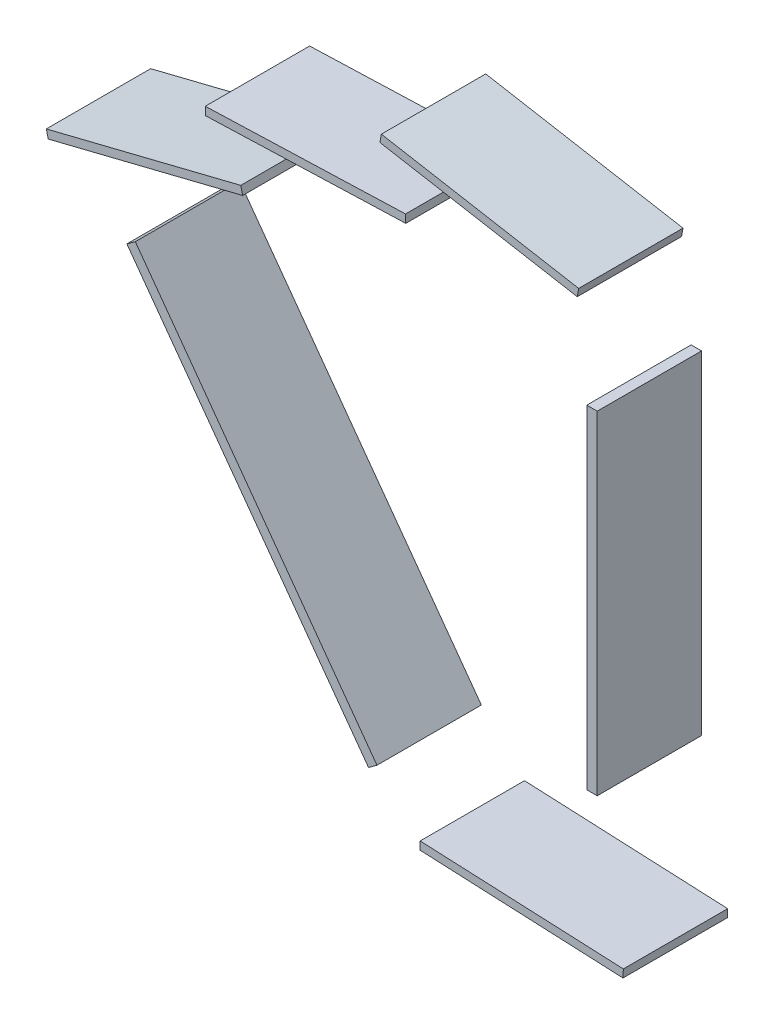
ISO-10303-21;
HEADER;
FILE_DESCRIPTION(('STEP AP214'),'2;1');
FILE_NAME('part.step','',(''),(''),'','','');
FILE_SCHEMA(('AUTOMOTIVE_DESIGN { 1 0 10303 214 1 1 1 1 }'));
ENDSEC;
DATA;
#1=APPLICATION_CONTEXT('core data for automotive mechanical design processes');
#2=APPLICATION_PROTOCOL_DEFINITION('international standard','automotive_design',2000,#1);
#3=PRODUCT_CONTEXT('',#1,'mechanical');
#4=PRODUCT('Part','Part','',(#3));
#5=PRODUCT_RELATED_PRODUCT_CATEGORY('part','',(#4));
#6=PRODUCT_DEFINITION_FORMATION('','',#4);
#7=PRODUCT_DEFINITION_CONTEXT('part definition',#1,'design');
#8=PRODUCT_DEFINITION('design','',#6,#7);
#9=PRODUCT_DEFINITION_SHAPE('','',#8);
#10=(LENGTH_UNIT() NAMED_UNIT(*) SI_UNIT(.MILLI.,.METRE.));
#11=(NAMED_UNIT(*) PLANE_ANGLE_UNIT() SI_UNIT($,.RADIAN.));
#12=(NAMED_UNIT(*) SI_UNIT($,.STERADIAN.) SOLID_ANGLE_UNIT());
#13=UNCERTAINTY_MEASURE_WITH_UNIT(LENGTH_MEASURE(1.E-05),#10,'distance_accuracy_value','');
#14=(GEOMETRIC_REPRESENTATION_CONTEXT(3) GLOBAL_UNCERTAINTY_ASSIGNED_CONTEXT((#13)) GLOBAL_UNIT_ASSIGNED_CONTEXT((#10,
#11,#12)) REPRESENTATION_CONTEXT('',''));
#15=CARTESIAN_POINT('',(0.,0.,0.));
#16=DIRECTION('',(0.,0.,1.));
#17=DIRECTION('',(1.,0.,0.));
#18=AXIS2_PLACEMENT_3D('',#15,#16,#17);
#19=CARTESIAN_POINT('',(-1.,38.7624072998269,10.));
#20=DIRECTION('',(1.,0.,0.));
#21=DIRECTION('',(0.,1.,0.));
#22=AXIS2_PLACEMENT_3D('',#19,#20,#21);
#23=PLANE('',#22);
#24=DIRECTION('',(0.,-1.,0.));
#25=VECTOR('',#24,1.);
#26=CARTESIAN_POINT('',(-1.,38.7624072998269,0.));
#27=LINE('',#26,#25);
#28=CARTESIAN_POINT('',(-1.,70.6810573309413,0.));
#29=VERTEX_POINT('',#28);
#30=CARTESIAN_POINT('',(-1.,38.7624072998269,0.));
#31=VERTEX_POINT('',#30);
#32=EDGE_CURVE('E106',#29,#31,#27,.T.);
#33=ORIENTED_EDGE('',*,*,#32,.T.);
#34=DIRECTION('',(0.,0.,-1.));
#35=VECTOR('',#34,1.);
#36=CARTESIAN_POINT('',(-1.,38.7624072998269,10.));
#37=LINE('',#36,#35);
#38=CARTESIAN_POINT('',(-1.,38.7624072998269,10.));
#39=VERTEX_POINT('',#38);
#40=EDGE_CURVE('E12',#39,#31,#37,.T.);
#41=ORIENTED_EDGE('',*,*,#40,.F.);
#42=DIRECTION('',(0.,-1.,0.));
#43=VECTOR('',#42,1.);
#44=CARTESIAN_POINT('',(-1.,38.7624072998269,10.));
#45=LINE('',#44,#43);
#46=CARTESIAN_POINT('',(-1.,70.6810573309413,10.));
#47=VERTEX_POINT('',#46);
#48=EDGE_CURVE('E94',#47,#39,#45,.T.);
#49=ORIENTED_EDGE('',*,*,#48,.F.);
#50=DIRECTION('',(0.,0.,-1.));
#51=VECTOR('',#50,1.);
#52=CARTESIAN_POINT('',(-1.,70.6810573309413,10.));
#53=LINE('',#52,#51);
#54=EDGE_CURVE('E102',#47,#29,#53,.T.);
#55=ORIENTED_EDGE('',*,*,#54,.T.);
#56=EDGE_LOOP('',(#33,#41,#49,#55));
#57=FACE_BOUND('',#56,.T.);
#58=ADVANCED_FACE('F43',(#57),#23,.F.);
#59=CARTESIAN_POINT('',(0.,38.7624072998269,10.));
#60=DIRECTION('',(0.,1.,0.));
#61=DIRECTION('',(0.,0.,1.));
#62=AXIS2_PLACEMENT_3D('',#59,#60,#61);
#63=PLANE('',#62);
#64=DIRECTION('',(1.,0.,0.));
#65=VECTOR('',#64,1.);
#66=CARTESIAN_POINT('',(0.,38.7624072998269,0.));
#67=LINE('',#66,#65);
#68=CARTESIAN_POINT('',(0.,38.7624072998269,0.));
#69=VERTEX_POINT('',#68);
#70=EDGE_CURVE('E98',#31,#69,#67,.T.);
#71=ORIENTED_EDGE('',*,*,#70,.T.);
#72=DIRECTION('',(0.,0.,-1.));
#73=VECTOR('',#72,1.);
#74=CARTESIAN_POINT('',(0.,38.7624072998269,10.));
#75=LINE('',#74,#73);
#76=CARTESIAN_POINT('',(0.,38.7624072998269,10.));
#77=VERTEX_POINT('',#76);
#78=EDGE_CURVE('E51',#77,#69,#75,.T.);
#79=ORIENTED_EDGE('',*,*,#78,.F.);
#80=DIRECTION('',(1.,0.,0.));
#81=VECTOR('',#80,1.);
#82=CARTESIAN_POINT('',(0.,38.7624072998269,10.));
#83=LINE('',#82,#81);
#84=EDGE_CURVE('E89',#39,#77,#83,.T.);
#85=ORIENTED_EDGE('',*,*,#84,.F.);
#86=ORIENTED_EDGE('',*,*,#40,.T.);
#87=EDGE_LOOP('',(#71,#79,#85,#86));
#88=FACE_BOUND('',#87,.T.);
#89=ADVANCED_FACE('F97',(#88),#63,.F.);
#90=CARTESIAN_POINT('',(0.,70.6810573309413,10.));
#91=DIRECTION('',(-1.,0.,0.));
#92=DIRECTION('',(0.,-1.,0.));
#93=AXIS2_PLACEMENT_3D('',#90,#91,#92);
#94=PLANE('',#93);
#95=DIRECTION('',(0.,1.,0.));
#96=VECTOR('',#95,1.);
#97=CARTESIAN_POINT('',(0.,70.6810573309413,0.));
#98=LINE('',#97,#96);
#99=CARTESIAN_POINT('',(0.,70.6810573309413,0.));
#100=VERTEX_POINT('',#99);
#101=EDGE_CURVE('E76',#69,#100,#98,.T.);
#102=ORIENTED_EDGE('',*,*,#101,.T.);
#103=DIRECTION('',(0.,0.,-1.));
#104=VECTOR('',#103,1.);
#105=CARTESIAN_POINT('',(0.,70.6810573309413,10.));
#106=LINE('',#105,#104);
#107=CARTESIAN_POINT('',(0.,70.6810573309413,10.));
#108=VERTEX_POINT('',#107);
#109=EDGE_CURVE('E99',#108,#100,#106,.T.);
#110=ORIENTED_EDGE('',*,*,#109,.F.);
#111=DIRECTION('',(0.,1.,0.));
#112=VECTOR('',#111,1.);
#113=CARTESIAN_POINT('',(0.,70.6810573309413,10.));
#114=LINE('',#113,#112);
#115=EDGE_CURVE('E92',#77,#108,#114,.T.);
#116=ORIENTED_EDGE('',*,*,#115,.F.);
#117=ORIENTED_EDGE('',*,*,#78,.T.);
#118=EDGE_LOOP('',(#102,#110,#116,#117));
#119=FACE_BOUND('',#118,.T.);
#120=ADVANCED_FACE('F100',(#119),#94,.F.);
#121=CARTESIAN_POINT('',(-1.,70.6810573309413,10.));
#122=DIRECTION('',(0.,-1.,0.));
#123=DIRECTION('',(1.,0.,0.));
#124=AXIS2_PLACEMENT_3D('',#121,#122,#123);
#125=PLANE('',#124);
#126=DIRECTION('',(-1.,0.,0.));
#127=VECTOR('',#126,1.);
#128=CARTESIAN_POINT('',(-1.,70.6810573309413,0.));
#129=LINE('',#128,#127);
#130=EDGE_CURVE('E82',#100,#29,#129,.T.);
#131=ORIENTED_EDGE('',*,*,#130,.T.);
#132=ORIENTED_EDGE('',*,*,#54,.F.);
#133=DIRECTION('',(-1.,0.,0.));
#134=VECTOR('',#133,1.);
#135=CARTESIAN_POINT('',(-1.,70.6810573309413,10.));
#136=LINE('',#135,#134);
#137=EDGE_CURVE('E59',#108,#47,#136,.T.);
#138=ORIENTED_EDGE('',*,*,#137,.F.);
#139=ORIENTED_EDGE('',*,*,#109,.T.);
#140=EDGE_LOOP('',(#131,#132,#138,#139));
#141=FACE_BOUND('',#140,.T.);
#142=ADVANCED_FACE('F113',(#141),#125,.F.);
#143=CARTESIAN_POINT('',(-1.,70.6810573309413,10.));
#144=DIRECTION('',(0.,0.,-1.));
#145=DIRECTION('',(-1.,0.,0.));
#146=AXIS2_PLACEMENT_3D('',#143,#144,#145);
#147=PLANE('',#146);
#148=ORIENTED_EDGE('',*,*,#48,.T.);
#149=ORIENTED_EDGE('',*,*,#84,.T.);
#150=ORIENTED_EDGE('',*,*,#115,.T.);
#151=ORIENTED_EDGE('',*,*,#137,.T.);
#152=EDGE_LOOP('',(#148,#149,#150,#151));
#153=FACE_BOUND('',#152,.T.);
#154=ADVANCED_FACE('F90',(#153),#147,.F.);
#155=CARTESIAN_POINT('',(-1.,70.6810573309413,0.));
#156=DIRECTION('',(0.,0.,-1.));
#157=DIRECTION('',(-1.,0.,0.));
#158=AXIS2_PLACEMENT_3D('',#155,#156,#157);
#159=PLANE('',#158);
#160=ORIENTED_EDGE('',*,*,#32,.F.);
#161=ORIENTED_EDGE('',*,*,#130,.F.);
#162=ORIENTED_EDGE('',*,*,#101,.F.);
#163=ORIENTED_EDGE('',*,*,#70,.F.);
#164=EDGE_LOOP('',(#160,#161,#162,#163));
#165=FACE_BOUND('',#164,.T.);
#166=ADVANCED_FACE('F116',(#165),#159,.T.);
#167=CLOSED_SHELL('',(#58,#89,#120,#142,#154,#166));
#168=MANIFOLD_SOLID_BREP('B2',#167);
#169=CARTESIAN_POINT('',(-21.910642755924,30.1574125551564,10.));
#170=DIRECTION('',(0.809016994374946,0.587785252292475,0.));
#171=DIRECTION('',(-0.587785252292475,0.809016994374946,0.));
#172=AXIS2_PLACEMENT_3D('',#169,#170,#171);
#173=PLANE('',#172);
#174=DIRECTION('',(0.587785252292475,-0.809016994374946,0.));
#175=VECTOR('',#174,1.);
#176=CARTESIAN_POINT('',(-21.910642755924,30.1574125551564,0.));
#177=LINE('',#176,#175);
#178=CARTESIAN_POINT('',(-45.0661788434705,62.0282737848731,0.));
#179=VERTEX_POINT('',#178);
#180=CARTESIAN_POINT('',(-21.910642755924,30.1574125551564,0.));
#181=VERTEX_POINT('',#180);
#182=EDGE_CURVE('E239',#179,#181,#177,.T.);
#183=ORIENTED_EDGE('',*,*,#182,.T.);
#184=DIRECTION('',(0.,0.,-1.));
#185=VECTOR('',#184,1.);
#186=CARTESIAN_POINT('',(-21.910642755924,30.1574125551564,10.));
#187=LINE('',#186,#185);
#188=CARTESIAN_POINT('',(-21.910642755924,30.1574125551564,10.));
#189=VERTEX_POINT('',#188);
#190=EDGE_CURVE('E41',#189,#181,#187,.T.);
#191=ORIENTED_EDGE('',*,*,#190,.F.);
#192=DIRECTION('',(0.587785252292475,-0.809016994374946,0.));
#193=VECTOR('',#192,1.);
#194=CARTESIAN_POINT('',(-21.910642755924,30.1574125551564,10.));
#195=LINE('',#194,#193);
#196=CARTESIAN_POINT('',(-45.0661788434705,62.0282737848731,10.));
#197=VERTEX_POINT('',#196);
#198=EDGE_CURVE('E227',#197,#189,#195,.T.);
#199=ORIENTED_EDGE('',*,*,#198,.F.);
#200=DIRECTION('',(0.,0.,-1.));
#201=VECTOR('',#200,1.);
#202=CARTESIAN_POINT('',(-45.0661788434705,62.0282737848731,10.));
#203=LINE('',#202,#201);
#204=EDGE_CURVE('E235',#197,#179,#203,.T.);
#205=ORIENTED_EDGE('',*,*,#204,.T.);
#206=EDGE_LOOP('',(#183,#191,#199,#205));
#207=FACE_BOUND('',#206,.T.);
#208=ADVANCED_FACE('F176',(#207),#173,.F.);
#209=CARTESIAN_POINT('',(-21.1016257615491,30.7451978074489,10.));
#210=DIRECTION('',(-0.587785252292471,0.809016994374949,0.));
#211=DIRECTION('',(-0.809016994374949,-0.587785252292471,0.));
#212=AXIS2_PLACEMENT_3D('',#209,#210,#211);
#213=PLANE('',#212);
#214=DIRECTION('',(0.809016994374949,0.587785252292471,0.));
#215=VECTOR('',#214,1.);
#216=CARTESIAN_POINT('',(-21.1016257615491,30.7451978074489,0.));
#217=LINE('',#216,#215);
#218=CARTESIAN_POINT('',(-21.1016257615491,30.7451978074489,0.));
#219=VERTEX_POINT('',#218);
#220=EDGE_CURVE('E231',#181,#219,#217,.T.);
#221=ORIENTED_EDGE('',*,*,#220,.T.);
#222=DIRECTION('',(0.,0.,-1.));
#223=VECTOR('',#222,1.);
#224=CARTESIAN_POINT('',(-21.1016257615491,30.7451978074489,10.));
#225=LINE('',#224,#223);
#226=CARTESIAN_POINT('',(-21.1016257615491,30.7451978074489,10.));
#227=VERTEX_POINT('',#226);
#228=EDGE_CURVE('E184',#227,#219,#225,.T.);
#229=ORIENTED_EDGE('',*,*,#228,.F.);
#230=DIRECTION('',(0.809016994374949,0.587785252292471,0.));
#231=VECTOR('',#230,1.);
#232=CARTESIAN_POINT('',(-21.1016257615491,30.7451978074489,10.));
#233=LINE('',#232,#231);
#234=EDGE_CURVE('E222',#189,#227,#233,.T.);
#235=ORIENTED_EDGE('',*,*,#234,.F.);
#236=ORIENTED_EDGE('',*,*,#190,.T.);
#237=EDGE_LOOP('',(#221,#229,#235,#236));
#238=FACE_BOUND('',#237,.T.);
#239=ADVANCED_FACE('F230',(#238),#213,.F.);
#240=CARTESIAN_POINT('',(-44.2571618490956,62.6160590371655,10.));
#241=DIRECTION('',(-0.809016994374946,-0.587785252292475,0.));
#242=DIRECTION('',(0.587785252292475,-0.809016994374946,0.));
#243=AXIS2_PLACEMENT_3D('',#240,#241,#242);
#244=PLANE('',#243);
#245=DIRECTION('',(-0.587785252292475,0.809016994374946,0.));
#246=VECTOR('',#245,1.);
#247=CARTESIAN_POINT('',(-44.2571618490956,62.6160590371655,0.));
#248=LINE('',#247,#246);
#249=CARTESIAN_POINT('',(-44.2571618490956,62.6160590371655,0.));
#250=VERTEX_POINT('',#249);
#251=EDGE_CURVE('E209',#219,#250,#248,.T.);
#252=ORIENTED_EDGE('',*,*,#251,.T.);
#253=DIRECTION('',(0.,0.,-1.));
#254=VECTOR('',#253,1.);
#255=CARTESIAN_POINT('',(-44.2571618490956,62.6160590371655,10.));
#256=LINE('',#255,#254);
#257=CARTESIAN_POINT('',(-44.2571618490956,62.6160590371655,10.));
#258=VERTEX_POINT('',#257);
#259=EDGE_CURVE('E232',#258,#250,#256,.T.);
#260=ORIENTED_EDGE('',*,*,#259,.F.);
#261=DIRECTION('',(-0.587785252292475,0.809016994374946,0.));
#262=VECTOR('',#261,1.);
#263=CARTESIAN_POINT('',(-44.2571618490956,62.6160590371655,10.));
#264=LINE('',#263,#262);
#265=EDGE_CURVE('E225',#227,#258,#264,.T.);
#266=ORIENTED_EDGE('',*,*,#265,.F.);
#267=ORIENTED_EDGE('',*,*,#228,.T.);
#268=EDGE_LOOP('',(#252,#260,#266,#267));
#269=FACE_BOUND('',#268,.T.);
#270=ADVANCED_FACE('F233',(#269),#244,.F.);
#271=CARTESIAN_POINT('',(-45.0661788434705,62.0282737848731,10.));
#272=DIRECTION('',(0.587785252292479,-0.809016994374943,0.));
#273=DIRECTION('',(0.809016994374943,0.587785252292479,0.));
#274=AXIS2_PLACEMENT_3D('',#271,#272,#273);
#275=PLANE('',#274);
#276=DIRECTION('',(-0.809016994374943,-0.587785252292479,0.));
#277=VECTOR('',#276,1.);
#278=CARTESIAN_POINT('',(-45.0661788434705,62.0282737848731,0.));
#279=LINE('',#278,#277);
#280=EDGE_CURVE('E215',#250,#179,#279,.T.);
#281=ORIENTED_EDGE('',*,*,#280,.T.);
#282=ORIENTED_EDGE('',*,*,#204,.F.);
#283=DIRECTION('',(-0.809016994374943,-0.587785252292479,0.));
#284=VECTOR('',#283,1.);
#285=CARTESIAN_POINT('',(-45.0661788434705,62.0282737848731,10.));
#286=LINE('',#285,#284);
#287=EDGE_CURVE('E192',#258,#197,#286,.T.);
#288=ORIENTED_EDGE('',*,*,#287,.F.);
#289=ORIENTED_EDGE('',*,*,#259,.T.);
#290=EDGE_LOOP('',(#281,#282,#288,#289));
#291=FACE_BOUND('',#290,.T.);
#292=ADVANCED_FACE('F246',(#291),#275,.F.);
#293=CARTESIAN_POINT('',(-45.0661788434705,62.0282737848731,10.));
#294=DIRECTION('',(0.,0.,-1.));
#295=DIRECTION('',(-1.,0.,0.));
#296=AXIS2_PLACEMENT_3D('',#293,#294,#295);
#297=PLANE('',#296);
#298=ORIENTED_EDGE('',*,*,#198,.T.);
#299=ORIENTED_EDGE('',*,*,#234,.T.);
#300=ORIENTED_EDGE('',*,*,#265,.T.);
#301=ORIENTED_EDGE('',*,*,#287,.T.);
#302=EDGE_LOOP('',(#298,#299,#300,#301));
#303=FACE_BOUND('',#302,.T.);
#304=ADVANCED_FACE('F223',(#303),#297,.F.);
#305=CARTESIAN_POINT('',(-45.0661788434705,62.0282737848731,0.));
#306=DIRECTION('',(0.,0.,-1.));
#307=DIRECTION('',(-1.,0.,0.));
#308=AXIS2_PLACEMENT_3D('',#305,#306,#307);
#309=PLANE('',#308);
#310=ORIENTED_EDGE('',*,*,#182,.F.);
#311=ORIENTED_EDGE('',*,*,#280,.F.);
#312=ORIENTED_EDGE('',*,*,#251,.F.);
#313=ORIENTED_EDGE('',*,*,#220,.F.);
#314=EDGE_LOOP('',(#310,#311,#312,#313));
#315=FACE_BOUND('',#314,.T.);
#316=ADVANCED_FACE('F249',(#315),#309,.T.);
#317=CLOSED_SHELL('',(#208,#239,#270,#292,#304,#316));
#318=MANIFOLD_SOLID_BREP('B6',#317);
#319=CARTESIAN_POINT('',(-16.9638016194686,26.5341118977669,10.));
#320=DIRECTION('',(0.998967048924741,-0.0454404573325794,0.));
#321=DIRECTION('',(0.0454404573325794,0.998967048924741,0.));
#322=AXIS2_PLACEMENT_3D('',#319,#320,#321);
#323=PLANE('',#322);
#324=DIRECTION('',(-0.0454404573325795,-0.998967048924741,0.));
#325=VECTOR('',#324,1.);
#326=CARTESIAN_POINT('',(-16.9638016194686,26.5341118977669,0.));
#327=LINE('',#326,#325);
#328=CARTESIAN_POINT('',(-16.9638016194686,26.5341118977669,0.));
#329=VERTEX_POINT('',#328);
#330=CARTESIAN_POINT('',(-16.9988634763464,25.7633089228166,0.));
#331=VERTEX_POINT('',#330);
#332=EDGE_CURVE('E363',#329,#331,#327,.T.);
#333=ORIENTED_EDGE('',*,*,#332,.T.);
#334=DIRECTION('',(0.,0.,-1.));
#335=VECTOR('',#334,1.);
#336=CARTESIAN_POINT('',(-16.9988634763464,25.7633089228166,10.));
#337=LINE('',#336,#335);
#338=CARTESIAN_POINT('',(-16.9988634763464,25.7633089228166,10.));
#339=VERTEX_POINT('',#338);
#340=EDGE_CURVE('E317',#339,#331,#337,.T.);
#341=ORIENTED_EDGE('',*,*,#340,.F.);
#342=DIRECTION('',(-0.0454404573325795,-0.998967048924741,0.));
#343=VECTOR('',#342,1.);
#344=CARTESIAN_POINT('',(-16.9638016194686,26.5341118977669,10.));
#345=LINE('',#344,#343);
#346=CARTESIAN_POINT('',(-16.9638016194686,26.5341118977669,10.));
#347=VERTEX_POINT('',#346);
#348=EDGE_CURVE('E355',#347,#339,#345,.T.);
#349=ORIENTED_EDGE('',*,*,#348,.F.);
#350=DIRECTION('',(0.,0.,-1.));
#351=VECTOR('',#350,1.);
#352=CARTESIAN_POINT('',(-16.9638016194686,26.5341118977669,10.));
#353=LINE('',#352,#351);
#354=EDGE_CURVE('E174',#347,#329,#353,.T.);
#355=ORIENTED_EDGE('',*,*,#354,.T.);
#356=EDGE_LOOP('',(#333,#341,#349,#355));
#357=FACE_BOUND('',#356,.T.);
#358=ADVANCED_FACE('F309',(#357),#323,.F.);
#359=CARTESIAN_POINT('',(-16.7108612761414,25.7502084389676,10.));
#360=DIRECTION('',(0.045440457332583,0.998967048924741,0.));
#361=DIRECTION('',(-0.998967048924741,0.045440457332583,0.));
#362=AXIS2_PLACEMENT_3D('',#359,#360,#361);
#363=PLANE('',#362);
#364=DIRECTION('',(0.998967048924741,-0.045440457332583,0.));
#365=VECTOR('',#364,1.);
#366=CARTESIAN_POINT('',(-16.7108612761414,25.7502084389676,0.));
#367=LINE('',#366,#365);
#368=CARTESIAN_POINT('',(2.46930606321363,24.877751658182,0.));
#369=VERTEX_POINT('',#368);
#370=EDGE_CURVE('E342',#331,#369,#367,.T.);
#371=ORIENTED_EDGE('',*,*,#370,.T.);
#372=DIRECTION('',(0.,0.,-1.));
#373=VECTOR('',#372,1.);
#374=CARTESIAN_POINT('',(2.46930606321363,24.877751658182,10.));
#375=LINE('',#374,#373);
#376=CARTESIAN_POINT('',(2.46930606321363,24.877751658182,10.));
#377=VERTEX_POINT('',#376);
#378=EDGE_CURVE('E364',#377,#369,#375,.T.);
#379=ORIENTED_EDGE('',*,*,#378,.F.);
#380=DIRECTION('',(0.998967048924741,-0.045440457332584,0.));
#381=VECTOR('',#380,1.);
#382=CARTESIAN_POINT('',(-16.9988634763464,25.7633089228166,10.));
#383=LINE('',#382,#381);
#384=EDGE_CURVE('E359',#339,#377,#383,.T.);
#385=ORIENTED_EDGE('',*,*,#384,.F.);
#386=ORIENTED_EDGE('',*,*,#340,.T.);
#387=EDGE_LOOP('',(#371,#379,#385,#386));
#388=FACE_BOUND('',#387,.T.);
#389=ADVANCED_FACE('F365',(#388),#363,.F.);
#390=CARTESIAN_POINT('',(2.50436792009146,25.6485546331323,10.));
#391=DIRECTION('',(-0.99896704892474,0.0454404573326004,0.));
#392=DIRECTION('',(-0.0454404573326004,-0.99896704892474,0.));
#393=AXIS2_PLACEMENT_3D('',#390,#391,#392);
#394=PLANE('',#393);
#395=DIRECTION('',(0.0454404573326004,0.99896704892474,0.));
#396=VECTOR('',#395,1.);
#397=CARTESIAN_POINT('',(2.50436792009146,25.6485546331323,0.));
#398=LINE('',#397,#396);
#399=CARTESIAN_POINT('',(2.50436792009146,25.6485546331323,0.));
#400=VERTEX_POINT('',#399);
#401=EDGE_CURVE('E349',#369,#400,#398,.T.);
#402=ORIENTED_EDGE('',*,*,#401,.T.);
#403=DIRECTION('',(0.,0.,-1.));
#404=VECTOR('',#403,1.);
#405=CARTESIAN_POINT('',(2.50436792009146,25.6485546331323,10.));
#406=LINE('',#405,#404);
#407=CARTESIAN_POINT('',(2.50436792009146,25.6485546331323,10.));
#408=VERTEX_POINT('',#407);
#409=EDGE_CURVE('E369',#408,#400,#406,.T.);
#410=ORIENTED_EDGE('',*,*,#409,.F.);
#411=DIRECTION('',(0.0454404573326004,0.99896704892474,0.));
#412=VECTOR('',#411,1.);
#413=CARTESIAN_POINT('',(2.50436792009146,25.6485546331323,10.));
#414=LINE('',#413,#412);
#415=EDGE_CURVE('E367',#377,#408,#414,.T.);
#416=ORIENTED_EDGE('',*,*,#415,.F.);
#417=ORIENTED_EDGE('',*,*,#378,.T.);
#418=EDGE_LOOP('',(#402,#410,#416,#417));
#419=FACE_BOUND('',#418,.T.);
#420=ADVANCED_FACE('F379',(#419),#394,.F.);
#421=CARTESIAN_POINT('',(-16.6757994192636,26.5210114139179,10.));
#422=DIRECTION('',(-0.045440457332583,-0.998967048924741,0.));
#423=DIRECTION('',(0.998967048924741,-0.045440457332583,0.));
#424=AXIS2_PLACEMENT_3D('',#421,#422,#423);
#425=PLANE('',#424);
#426=DIRECTION('',(-0.998967048924741,0.045440457332583,0.));
#427=VECTOR('',#426,1.);
#428=CARTESIAN_POINT('',(-16.6757994192636,26.5210114139179,0.));
#429=LINE('',#428,#427);
#430=EDGE_CURVE('E376',#400,#329,#429,.T.);
#431=ORIENTED_EDGE('',*,*,#430,.T.);
#432=ORIENTED_EDGE('',*,*,#354,.F.);
#433=DIRECTION('',(-0.998967048924742,0.0454404573325589,0.));
#434=VECTOR('',#433,1.);
#435=CARTESIAN_POINT('',(-16.6757994192636,26.5210114139179,10.));
#436=LINE('',#435,#434);
#437=EDGE_CURVE('E325',#408,#347,#436,.T.);
#438=ORIENTED_EDGE('',*,*,#437,.F.);
#439=ORIENTED_EDGE('',*,*,#409,.T.);
#440=EDGE_LOOP('',(#431,#432,#438,#439));
#441=FACE_BOUND('',#440,.T.);
#442=ADVANCED_FACE('F383',(#441),#425,.F.);
#443=CARTESIAN_POINT('',(-16.9638016194686,26.5341118977669,10.));
#444=DIRECTION('',(0.,0.,1.));
#445=DIRECTION('',(1.,0.,0.));
#446=AXIS2_PLACEMENT_3D('',#443,#444,#445);
#447=PLANE('',#446);
#448=ORIENTED_EDGE('',*,*,#437,.T.);
#449=ORIENTED_EDGE('',*,*,#348,.T.);
#450=ORIENTED_EDGE('',*,*,#384,.T.);
#451=ORIENTED_EDGE('',*,*,#415,.T.);
#452=EDGE_LOOP('',(#448,#449,#450,#451));
#453=FACE_BOUND('',#452,.T.);
#454=ADVANCED_FACE('F357',(#453),#447,.T.);
#455=CARTESIAN_POINT('',(-16.9638016194686,26.5341118977669,0.));
#456=DIRECTION('',(0.,0.,1.));
#457=DIRECTION('',(1.,0.,0.));
#458=AXIS2_PLACEMENT_3D('',#455,#456,#457);
#459=PLANE('',#458);
#460=ORIENTED_EDGE('',*,*,#332,.F.);
#461=ORIENTED_EDGE('',*,*,#430,.F.);
#462=ORIENTED_EDGE('',*,*,#401,.F.);
#463=ORIENTED_EDGE('',*,*,#370,.F.);
#464=EDGE_LOOP('',(#460,#461,#462,#463));
#465=FACE_BOUND('',#464,.T.);
#466=ADVANCED_FACE('F382',(#465),#459,.F.);
#467=CLOSED_SHELL('',(#358,#389,#420,#442,#454,#466));
#468=MANIFOLD_SOLID_BREP('B35',#467);
#469=CARTESIAN_POINT('',(-20.6826291580252,83.3264981054563,10.));
#470=DIRECTION('',(-0.174282532081888,-0.98469568853079,0.));
#471=DIRECTION('',(0.98469568853079,-0.174282532081888,0.));
#472=AXIS2_PLACEMENT_3D('',#469,#470,#471);
#473=PLANE('',#472);
#474=DIRECTION('',(-0.98469568853079,0.174282532081888,0.));
#475=VECTOR('',#474,1.);
#476=CARTESIAN_POINT('',(-20.6826291580252,83.3264981054563,0.));
#477=LINE('',#476,#475);
#478=CARTESIAN_POINT('',(-1.77647193823407,79.9802734894841,0.));
#479=VERTEX_POINT('',#478);
#480=CARTESIAN_POINT('',(-20.6826291580252,83.3264981054563,0.));
#481=VERTEX_POINT('',#480);
#482=EDGE_CURVE('E511',#479,#481,#477,.T.);
#483=ORIENTED_EDGE('',*,*,#482,.T.);
#484=DIRECTION('',(0.,0.,-1.));
#485=VECTOR('',#484,1.);
#486=CARTESIAN_POINT('',(-20.6826291580252,83.3264981054563,10.));
#487=LINE('',#486,#485);
#488=CARTESIAN_POINT('',(-20.6826291580252,83.3264981054563,10.));
#489=VERTEX_POINT('',#488);
#490=EDGE_CURVE('E307',#489,#481,#487,.T.);
#491=ORIENTED_EDGE('',*,*,#490,.F.);
#492=DIRECTION('',(-0.98469568853079,0.174282532081888,0.));
#493=VECTOR('',#492,1.);
#494=CARTESIAN_POINT('',(-20.6826291580252,83.3264981054563,10.));
#495=LINE('',#494,#493);
#496=CARTESIAN_POINT('',(-1.77647193823407,79.9802734894841,10.));
#497=VERTEX_POINT('',#496);
#498=EDGE_CURVE('E499',#497,#489,#495,.T.);
#499=ORIENTED_EDGE('',*,*,#498,.F.);
#500=DIRECTION('',(0.,0.,-1.));
#501=VECTOR('',#500,1.);
#502=CARTESIAN_POINT('',(-1.77647193823407,79.9802734894841,10.));
#503=LINE('',#502,#501);
#504=EDGE_CURVE('E507',#497,#479,#503,.T.);
#505=ORIENTED_EDGE('',*,*,#504,.T.);
#506=EDGE_LOOP('',(#483,#491,#499,#505));
#507=FACE_BOUND('',#506,.T.);
#508=ADVANCED_FACE('F448',(#507),#473,.F.);
#509=CARTESIAN_POINT('',(-20.6826291580252,83.3264981054563,10.));
#510=DIRECTION('',(0.984695688530788,-0.174282532081897,0.));
#511=DIRECTION('',(0.174282532081897,0.984695688530788,0.));
#512=AXIS2_PLACEMENT_3D('',#509,#510,#511);
#513=PLANE('',#512);
#514=DIRECTION('',(-0.174282532081897,-0.984695688530788,0.));
#515=VECTOR('',#514,1.);
#516=CARTESIAN_POINT('',(-20.6826291580252,83.3264981054563,0.));
#517=LINE('',#516,#515);
#518=CARTESIAN_POINT('',(-20.8171055597796,82.566706912186,0.));
#519=VERTEX_POINT('',#518);
#520=EDGE_CURVE('E503',#481,#519,#517,.T.);
#521=ORIENTED_EDGE('',*,*,#520,.T.);
#522=DIRECTION('',(0.,0.,-1.));
#523=VECTOR('',#522,1.);
#524=CARTESIAN_POINT('',(-20.8171055597796,82.566706912186,10.));
#525=LINE('',#524,#523);
#526=CARTESIAN_POINT('',(-20.8171055597796,82.566706912186,10.));
#527=VERTEX_POINT('',#526);
#528=EDGE_CURVE('E456',#527,#519,#525,.T.);
#529=ORIENTED_EDGE('',*,*,#528,.F.);
#530=DIRECTION('',(-0.174282532081897,-0.984695688530788,0.));
#531=VECTOR('',#530,1.);
#532=CARTESIAN_POINT('',(-20.6826291580252,83.3264981054563,10.));
#533=LINE('',#532,#531);
#534=EDGE_CURVE('E494',#489,#527,#533,.T.);
#535=ORIENTED_EDGE('',*,*,#534,.F.);
#536=ORIENTED_EDGE('',*,*,#490,.T.);
#537=EDGE_LOOP('',(#521,#529,#535,#536));
#538=FACE_BOUND('',#537,.T.);
#539=ADVANCED_FACE('F502',(#538),#513,.F.);
#540=CARTESIAN_POINT('',(-20.8171055597796,82.566706912186,10.));
#541=DIRECTION('',(0.174282532081888,0.98469568853079,0.));
#542=DIRECTION('',(-0.98469568853079,0.174282532081888,0.));
#543=AXIS2_PLACEMENT_3D('',#540,#541,#542);
#544=PLANE('',#543);
#545=DIRECTION('',(0.98469568853079,-0.174282532081888,0.));
#546=VECTOR('',#545,1.);
#547=CARTESIAN_POINT('',(-20.8171055597796,82.566706912186,0.));
#548=LINE('',#547,#546);
#549=CARTESIAN_POINT('',(-1.91094833998846,79.2204822962137,0.));
#550=VERTEX_POINT('',#549);
#551=EDGE_CURVE('E481',#519,#550,#548,.T.);
#552=ORIENTED_EDGE('',*,*,#551,.T.);
#553=DIRECTION('',(0.,0.,-1.));
#554=VECTOR('',#553,1.);
#555=CARTESIAN_POINT('',(-1.91094833998846,79.2204822962137,10.));
#556=LINE('',#555,#554);
#557=CARTESIAN_POINT('',(-1.91094833998846,79.2204822962137,10.));
#558=VERTEX_POINT('',#557);
#559=EDGE_CURVE('E504',#558,#550,#556,.T.);
#560=ORIENTED_EDGE('',*,*,#559,.F.);
#561=DIRECTION('',(0.98469568853079,-0.174282532081888,0.));
#562=VECTOR('',#561,1.);
#563=CARTESIAN_POINT('',(-20.8171055597796,82.566706912186,10.));
#564=LINE('',#563,#562);
#565=EDGE_CURVE('E497',#527,#558,#564,.T.);
#566=ORIENTED_EDGE('',*,*,#565,.F.);
#567=ORIENTED_EDGE('',*,*,#528,.T.);
#568=EDGE_LOOP('',(#552,#560,#566,#567));
#569=FACE_BOUND('',#568,.T.);
#570=ADVANCED_FACE('F505',(#569),#544,.F.);
#571=CARTESIAN_POINT('',(-1.77647193823407,79.9802734894841,10.));
#572=DIRECTION('',(-0.984695688530788,0.174282532081898,0.));
#573=DIRECTION('',(-0.174282532081898,-0.984695688530788,0.));
#574=AXIS2_PLACEMENT_3D('',#571,#572,#573);
#575=PLANE('',#574);
#576=DIRECTION('',(0.174282532081898,0.984695688530788,0.));
#577=VECTOR('',#576,1.);
#578=CARTESIAN_POINT('',(-1.77647193823407,79.9802734894841,0.));
#579=LINE('',#578,#577);
#580=EDGE_CURVE('E487',#550,#479,#579,.T.);
#581=ORIENTED_EDGE('',*,*,#580,.T.);
#582=ORIENTED_EDGE('',*,*,#504,.F.);
#583=DIRECTION('',(0.174282532081898,0.984695688530788,0.));
#584=VECTOR('',#583,1.);
#585=CARTESIAN_POINT('',(-1.77647193823407,79.9802734894841,10.));
#586=LINE('',#585,#584);
#587=EDGE_CURVE('E464',#558,#497,#586,.T.);
#588=ORIENTED_EDGE('',*,*,#587,.F.);
#589=ORIENTED_EDGE('',*,*,#559,.T.);
#590=EDGE_LOOP('',(#581,#582,#588,#589));
#591=FACE_BOUND('',#590,.T.);
#592=ADVANCED_FACE('F518',(#591),#575,.F.);
#593=CARTESIAN_POINT('',(-1.77647193823407,79.9802734894841,10.));
#594=DIRECTION('',(0.,0.,-1.));
#595=DIRECTION('',(-1.,0.,0.));
#596=AXIS2_PLACEMENT_3D('',#593,#594,#595);
#597=PLANE('',#596);
#598=ORIENTED_EDGE('',*,*,#498,.T.);
#599=ORIENTED_EDGE('',*,*,#534,.T.);
#600=ORIENTED_EDGE('',*,*,#565,.T.);
#601=ORIENTED_EDGE('',*,*,#587,.T.);
#602=EDGE_LOOP('',(#598,#599,#600,#601));
#603=FACE_BOUND('',#602,.T.);
#604=ADVANCED_FACE('F495',(#603),#597,.F.);
#605=CARTESIAN_POINT('',(-1.77647193823407,79.9802734894841,0.));
#606=DIRECTION('',(0.,0.,-1.));
#607=DIRECTION('',(-1.,0.,0.));
#608=AXIS2_PLACEMENT_3D('',#605,#606,#607);
#609=PLANE('',#608);
#610=ORIENTED_EDGE('',*,*,#482,.F.);
#611=ORIENTED_EDGE('',*,*,#580,.F.);
#612=ORIENTED_EDGE('',*,*,#551,.F.);
#613=ORIENTED_EDGE('',*,*,#520,.F.);
#614=EDGE_LOOP('',(#610,#611,#612,#613));
#615=FACE_BOUND('',#614,.T.);
#616=ADVANCED_FACE('F521',(#615),#609,.T.);
#617=CLOSED_SHELL('',(#508,#539,#570,#592,#604,#616));
#618=MANIFOLD_SOLID_BREP('B168',#617);
#619=CARTESIAN_POINT('',(-37.5552171988177,77.2054538006004,10.));
#620=DIRECTION('',(0.034255704937683,-0.99941310111446,0.));
#621=DIRECTION('',(0.99941310111446,0.034255704937683,0.));
#622=AXIS2_PLACEMENT_3D('',#619,#620,#621);
#623=PLANE('',#622);
#624=DIRECTION('',(-0.99941310111446,-0.034255704937683,0.));
#625=VECTOR('',#624,1.);
#626=CARTESIAN_POINT('',(-37.5552171988177,77.2054538006004,0.));
#627=LINE('',#626,#625);
#628=CARTESIAN_POINT('',(-18.3664856574201,77.8631633354039,0.));
#629=VERTEX_POINT('',#628);
#630=CARTESIAN_POINT('',(-37.5552171988177,77.2054538006004,0.));
#631=VERTEX_POINT('',#630);
#632=EDGE_CURVE('E643',#629,#631,#627,.T.);
#633=ORIENTED_EDGE('',*,*,#632,.T.);
#634=DIRECTION('',(0.,0.,-1.));
#635=VECTOR('',#634,1.);
#636=CARTESIAN_POINT('',(-37.5552171988177,77.2054538006004,10.));
#637=LINE('',#636,#635);
#638=CARTESIAN_POINT('',(-37.5552171988177,77.2054538006004,10.));
#639=VERTEX_POINT('',#638);
#640=EDGE_CURVE('E446',#639,#631,#637,.T.);
#641=ORIENTED_EDGE('',*,*,#640,.F.);
#642=DIRECTION('',(-0.99941310111446,-0.034255704937683,0.));
#643=VECTOR('',#642,1.);
#644=CARTESIAN_POINT('',(-37.5552171988177,77.2054538006004,10.));
#645=LINE('',#644,#643);
#646=CARTESIAN_POINT('',(-18.3664856574201,77.8631633354039,10.));
#647=VERTEX_POINT('',#646);
#648=EDGE_CURVE('E631',#647,#639,#645,.T.);
#649=ORIENTED_EDGE('',*,*,#648,.F.);
#650=DIRECTION('',(0.,0.,-1.));
#651=VECTOR('',#650,1.);
#652=CARTESIAN_POINT('',(-18.3664856574201,77.8631633354039,10.));
#653=LINE('',#652,#651);
#654=EDGE_CURVE('E639',#647,#629,#653,.T.);
#655=ORIENTED_EDGE('',*,*,#654,.T.);
#656=EDGE_LOOP('',(#633,#641,#649,#655));
#657=FACE_BOUND('',#656,.T.);
#658=ADVANCED_FACE('F580',(#657),#623,.F.);
#659=CARTESIAN_POINT('',(-37.5552171988177,77.2054538006004,10.));
#660=DIRECTION('',(0.99941310111446,0.0342557049376846,0.));
#661=DIRECTION('',(-0.0342557049376846,0.99941310111446,0.));
#662=AXIS2_PLACEMENT_3D('',#659,#660,#661);
#663=PLANE('',#662);
#664=DIRECTION('',(0.0342557049376846,-0.99941310111446,0.));
#665=VECTOR('',#664,1.);
#666=CARTESIAN_POINT('',(-37.5552171988177,77.2054538006004,0.));
#667=LINE('',#666,#665);
#668=CARTESIAN_POINT('',(-37.5287854968878,76.4343066517805,0.));
#669=VERTEX_POINT('',#668);
#670=EDGE_CURVE('E635',#631,#669,#667,.T.);
#671=ORIENTED_EDGE('',*,*,#670,.T.);
#672=DIRECTION('',(0.,0.,-1.));
#673=VECTOR('',#672,1.);
#674=CARTESIAN_POINT('',(-37.5287854968878,76.4343066517805,10.));
#675=LINE('',#674,#673);
#676=CARTESIAN_POINT('',(-37.5287854968878,76.4343066517805,10.));
#677=VERTEX_POINT('',#676);
#678=EDGE_CURVE('E588',#677,#669,#675,.T.);
#679=ORIENTED_EDGE('',*,*,#678,.F.);
#680=DIRECTION('',(0.0342557049376846,-0.99941310111446,0.));
#681=VECTOR('',#680,1.);
#682=CARTESIAN_POINT('',(-37.5552171988177,77.2054538006004,10.));
#683=LINE('',#682,#681);
#684=EDGE_CURVE('E626',#639,#677,#683,.T.);
#685=ORIENTED_EDGE('',*,*,#684,.F.);
#686=ORIENTED_EDGE('',*,*,#640,.T.);
#687=EDGE_LOOP('',(#671,#679,#685,#686));
#688=FACE_BOUND('',#687,.T.);
#689=ADVANCED_FACE('F634',(#688),#663,.F.);
#690=CARTESIAN_POINT('',(-37.5287854968878,76.4343066517805,10.));
#691=DIRECTION('',(-0.034255704937683,0.99941310111446,0.));
#692=DIRECTION('',(-0.99941310111446,-0.034255704937683,0.));
#693=AXIS2_PLACEMENT_3D('',#690,#691,#692);
#694=PLANE('',#693);
#695=DIRECTION('',(0.99941310111446,0.034255704937683,0.));
#696=VECTOR('',#695,1.);
#697=CARTESIAN_POINT('',(-37.5287854968878,76.4343066517805,0.));
#698=LINE('',#697,#696);
#699=CARTESIAN_POINT('',(-18.3400539554902,77.092016186584,0.));
#700=VERTEX_POINT('',#699);
#701=EDGE_CURVE('E613',#669,#700,#698,.T.);
#702=ORIENTED_EDGE('',*,*,#701,.T.);
#703=DIRECTION('',(0.,0.,-1.));
#704=VECTOR('',#703,1.);
#705=CARTESIAN_POINT('',(-18.3400539554902,77.092016186584,10.));
#706=LINE('',#705,#704);
#707=CARTESIAN_POINT('',(-18.3400539554902,77.092016186584,10.));
#708=VERTEX_POINT('',#707);
#709=EDGE_CURVE('E636',#708,#700,#706,.T.);
#710=ORIENTED_EDGE('',*,*,#709,.F.);
#711=DIRECTION('',(0.99941310111446,0.034255704937683,0.));
#712=VECTOR('',#711,1.);
#713=CARTESIAN_POINT('',(-37.5287854968878,76.4343066517805,10.));
#714=LINE('',#713,#712);
#715=EDGE_CURVE('E629',#677,#708,#714,.T.);
#716=ORIENTED_EDGE('',*,*,#715,.F.);
#717=ORIENTED_EDGE('',*,*,#678,.T.);
#718=EDGE_LOOP('',(#702,#710,#716,#717));
#719=FACE_BOUND('',#718,.T.);
#720=ADVANCED_FACE('F637',(#719),#694,.F.);
#721=CARTESIAN_POINT('',(-18.3664856574201,77.8631633354039,10.));
#722=DIRECTION('',(-0.999413101114461,-0.0342557049376756,0.));
#723=DIRECTION('',(0.0342557049376756,-0.999413101114461,0.));
#724=AXIS2_PLACEMENT_3D('',#721,#722,#723);
#725=PLANE('',#724);
#726=DIRECTION('',(-0.0342557049376756,0.999413101114461,0.));
#727=VECTOR('',#726,1.);
#728=CARTESIAN_POINT('',(-18.3664856574201,77.8631633354039,0.));
#729=LINE('',#728,#727);
#730=EDGE_CURVE('E619',#700,#629,#729,.T.);
#731=ORIENTED_EDGE('',*,*,#730,.T.);
#732=ORIENTED_EDGE('',*,*,#654,.F.);
#733=DIRECTION('',(-0.0342557049376756,0.999413101114461,0.));
#734=VECTOR('',#733,1.);
#735=CARTESIAN_POINT('',(-18.3664856574201,77.8631633354039,10.));
#736=LINE('',#735,#734);
#737=EDGE_CURVE('E596',#708,#647,#736,.T.);
#738=ORIENTED_EDGE('',*,*,#737,.F.);
#739=ORIENTED_EDGE('',*,*,#709,.T.);
#740=EDGE_LOOP('',(#731,#732,#738,#739));
#741=FACE_BOUND('',#740,.T.);
#742=ADVANCED_FACE('F650',(#741),#725,.F.);
#743=CARTESIAN_POINT('',(-18.3664856574201,77.8631633354039,10.));
#744=DIRECTION('',(0.,0.,-1.));
#745=DIRECTION('',(-1.,0.,0.));
#746=AXIS2_PLACEMENT_3D('',#743,#744,#745);
#747=PLANE('',#746);
#748=ORIENTED_EDGE('',*,*,#648,.T.);
#749=ORIENTED_EDGE('',*,*,#684,.T.);
#750=ORIENTED_EDGE('',*,*,#715,.T.);
#751=ORIENTED_EDGE('',*,*,#737,.T.);
#752=EDGE_LOOP('',(#748,#749,#750,#751));
#753=FACE_BOUND('',#752,.T.);
#754=ADVANCED_FACE('F627',(#753),#747,.F.);
#755=CARTESIAN_POINT('',(-18.3664856574201,77.8631633354039,0.));
#756=DIRECTION('',(0.,0.,-1.));
#757=DIRECTION('',(-1.,0.,0.));
#758=AXIS2_PLACEMENT_3D('',#755,#756,#757);
#759=PLANE('',#758);
#760=ORIENTED_EDGE('',*,*,#632,.F.);
#761=ORIENTED_EDGE('',*,*,#730,.F.);
#762=ORIENTED_EDGE('',*,*,#701,.F.);
#763=ORIENTED_EDGE('',*,*,#670,.F.);
#764=EDGE_LOOP('',(#760,#761,#762,#763));
#765=FACE_BOUND('',#764,.T.);
#766=ADVANCED_FACE('F653',(#765),#759,.T.);
#767=CLOSED_SHELL('',(#658,#689,#720,#742,#754,#766));
#768=MANIFOLD_SOLID_BREP('B301',#767);
#769=CARTESIAN_POINT('',(-52.7864620380958,67.7101606917875,10.));
#770=DIRECTION('',(0.241296803274367,-0.970451365463294,0.));
#771=DIRECTION('',(0.970451365463294,0.241296803274367,0.));
#772=AXIS2_PLACEMENT_3D('',#769,#770,#771);
#773=PLANE('',#772);
#774=DIRECTION('',(-0.970451365463294,-0.241296803274367,0.));
#775=VECTOR('',#774,1.);
#776=CARTESIAN_POINT('',(-52.7864620380958,67.7101606917875,0.));
#777=LINE('',#776,#775);
#778=CARTESIAN_POINT('',(-34.1537958212005,72.3430593146554,0.));
#779=VERTEX_POINT('',#778);
#780=CARTESIAN_POINT('',(-52.7864620380958,67.7101606917875,0.));
#781=VERTEX_POINT('',#780);
#782=EDGE_CURVE('E766',#779,#781,#777,.T.);
#783=ORIENTED_EDGE('',*,*,#782,.T.);
#784=DIRECTION('',(0.,0.,-1.));
#785=VECTOR('',#784,1.);
#786=CARTESIAN_POINT('',(-52.7864620380958,67.7101606917875,10.));
#787=LINE('',#786,#785);
#788=CARTESIAN_POINT('',(-52.7864620380958,67.7101606917875,10.));
#789=VERTEX_POINT('',#788);
#790=EDGE_CURVE('E578',#789,#781,#787,.T.);
#791=ORIENTED_EDGE('',*,*,#790,.F.);
#792=DIRECTION('',(-0.970451365463294,-0.241296803274367,0.));
#793=VECTOR('',#792,1.);
#794=CARTESIAN_POINT('',(-52.7864620380958,67.7101606917875,10.));
#795=LINE('',#794,#793);
#796=CARTESIAN_POINT('',(-34.1537958212005,72.3430593146554,10.));
#797=VERTEX_POINT('',#796);
#798=EDGE_CURVE('E754',#797,#789,#795,.T.);
#799=ORIENTED_EDGE('',*,*,#798,.F.);
#800=DIRECTION('',(0.,0.,-1.));
#801=VECTOR('',#800,1.);
#802=CARTESIAN_POINT('',(-34.1537958212005,72.3430593146554,10.));
#803=LINE('',#802,#801);
#804=EDGE_CURVE('E762',#797,#779,#803,.T.);
#805=ORIENTED_EDGE('',*,*,#804,.T.);
#806=EDGE_LOOP('',(#783,#791,#799,#805));
#807=FACE_BOUND('',#806,.T.);
#808=ADVANCED_FACE('F703',(#807),#773,.F.);
#809=CARTESIAN_POINT('',(-52.7864620380958,67.7101606917875,10.));
#810=DIRECTION('',(0.970451365463291,0.24129680327438,0.));
#811=DIRECTION('',(-0.24129680327438,0.970451365463291,0.));
#812=AXIS2_PLACEMENT_3D('',#809,#810,#811);
#813=PLANE('',#812);
#814=DIRECTION('',(0.24129680327438,-0.970451365463291,0.));
#815=VECTOR('',#814,1.);
#816=CARTESIAN_POINT('',(-52.7864620380958,67.7101606917875,0.));
#817=LINE('',#816,#815);
#818=CARTESIAN_POINT('',(-52.6002774246893,66.9613604181961,0.));
#819=VERTEX_POINT('',#818);
#820=EDGE_CURVE('E758',#781,#819,#817,.T.);
#821=ORIENTED_EDGE('',*,*,#820,.T.);
#822=DIRECTION('',(0.,0.,-1.));
#823=VECTOR('',#822,1.);
#824=CARTESIAN_POINT('',(-52.6002774246893,66.9613604181961,10.));
#825=LINE('',#824,#823);
#826=CARTESIAN_POINT('',(-52.6002774246893,66.9613604181961,10.));
#827=VERTEX_POINT('',#826);
#828=EDGE_CURVE('E711',#827,#819,#825,.T.);
#829=ORIENTED_EDGE('',*,*,#828,.F.);
#830=DIRECTION('',(0.24129680327438,-0.970451365463291,0.));
#831=VECTOR('',#830,1.);
#832=CARTESIAN_POINT('',(-52.7864620380958,67.7101606917875,10.));
#833=LINE('',#832,#831);
#834=EDGE_CURVE('E749',#789,#827,#833,.T.);
#835=ORIENTED_EDGE('',*,*,#834,.F.);
#836=ORIENTED_EDGE('',*,*,#790,.T.);
#837=EDGE_LOOP('',(#821,#829,#835,#836));
#838=FACE_BOUND('',#837,.T.);
#839=ADVANCED_FACE('F757',(#838),#813,.F.);
#840=CARTESIAN_POINT('',(-52.6002774246893,66.9613604181961,10.));
#841=DIRECTION('',(-0.241296803274367,0.970451365463294,0.));
#842=DIRECTION('',(-0.970451365463294,-0.241296803274367,0.));
#843=AXIS2_PLACEMENT_3D('',#840,#841,#842);
#844=PLANE('',#843);
#845=DIRECTION('',(0.970451365463294,0.241296803274367,0.));
#846=VECTOR('',#845,1.);
#847=CARTESIAN_POINT('',(-52.6002774246893,66.9613604181961,0.));
#848=LINE('',#847,#846);
#849=CARTESIAN_POINT('',(-33.967611207794,71.5942590410639,0.));
#850=VERTEX_POINT('',#849);
#851=EDGE_CURVE('E736',#819,#850,#848,.T.);
#852=ORIENTED_EDGE('',*,*,#851,.T.);
#853=DIRECTION('',(0.,0.,-1.));
#854=VECTOR('',#853,1.);
#855=CARTESIAN_POINT('',(-33.967611207794,71.5942590410639,10.));
#856=LINE('',#855,#854);
#857=CARTESIAN_POINT('',(-33.967611207794,71.5942590410639,10.));
#858=VERTEX_POINT('',#857);
#859=EDGE_CURVE('E759',#858,#850,#856,.T.);
#860=ORIENTED_EDGE('',*,*,#859,.F.);
#861=DIRECTION('',(0.970451365463294,0.241296803274367,0.));
#862=VECTOR('',#861,1.);
#863=CARTESIAN_POINT('',(-52.6002774246893,66.9613604181961,10.));
#864=LINE('',#863,#862);
#865=EDGE_CURVE('E752',#827,#858,#864,.T.);
#866=ORIENTED_EDGE('',*,*,#865,.F.);
#867=ORIENTED_EDGE('',*,*,#828,.T.);
#868=EDGE_LOOP('',(#852,#860,#866,#867));
#869=FACE_BOUND('',#868,.T.);
#870=ADVANCED_FACE('F760',(#869),#844,.F.);
#871=CARTESIAN_POINT('',(-34.1537958212005,72.3430593146554,10.));
#872=DIRECTION('',(-0.970451365463291,-0.24129680327438,0.));
#873=DIRECTION('',(0.24129680327438,-0.970451365463291,0.));
#874=AXIS2_PLACEMENT_3D('',#871,#872,#873);
#875=PLANE('',#874);
#876=DIRECTION('',(-0.24129680327438,0.970451365463291,0.));
#877=VECTOR('',#876,1.);
#878=CARTESIAN_POINT('',(-34.1537958212005,72.3430593146554,0.));
#879=LINE('',#878,#877);
#880=EDGE_CURVE('E742',#850,#779,#879,.T.);
#881=ORIENTED_EDGE('',*,*,#880,.T.);
#882=ORIENTED_EDGE('',*,*,#804,.F.);
#883=DIRECTION('',(-0.24129680327438,0.970451365463291,0.));
#884=VECTOR('',#883,1.);
#885=CARTESIAN_POINT('',(-34.1537958212005,72.3430593146554,10.));
#886=LINE('',#885,#884);
#887=EDGE_CURVE('E719',#858,#797,#886,.T.);
#888=ORIENTED_EDGE('',*,*,#887,.F.);
#889=ORIENTED_EDGE('',*,*,#859,.T.);
#890=EDGE_LOOP('',(#881,#882,#888,#889));
#891=FACE_BOUND('',#890,.T.);
#892=ADVANCED_FACE('F773',(#891),#875,.F.);
#893=CARTESIAN_POINT('',(-34.1537958212005,72.3430593146554,10.));
#894=DIRECTION('',(0.,0.,-1.));
#895=DIRECTION('',(-1.,0.,0.));
#896=AXIS2_PLACEMENT_3D('',#893,#894,#895);
#897=PLANE('',#896);
#898=ORIENTED_EDGE('',*,*,#798,.T.);
#899=ORIENTED_EDGE('',*,*,#834,.T.);
#900=ORIENTED_EDGE('',*,*,#865,.T.);
#901=ORIENTED_EDGE('',*,*,#887,.T.);
#902=EDGE_LOOP('',(#898,#899,#900,#901));
#903=FACE_BOUND('',#902,.T.);
#904=ADVANCED_FACE('F750',(#903),#897,.F.);
#905=CARTESIAN_POINT('',(-34.1537958212005,72.3430593146554,0.));
#906=DIRECTION('',(0.,0.,-1.));
#907=DIRECTION('',(-1.,0.,0.));
#908=AXIS2_PLACEMENT_3D('',#905,#906,#907);
#909=PLANE('',#908);
#910=ORIENTED_EDGE('',*,*,#782,.F.);
#911=ORIENTED_EDGE('',*,*,#880,.F.);
#912=ORIENTED_EDGE('',*,*,#851,.F.);
#913=ORIENTED_EDGE('',*,*,#820,.F.);
#914=EDGE_LOOP('',(#910,#911,#912,#913));
#915=FACE_BOUND('',#914,.T.);
#916=ADVANCED_FACE('F776',(#915),#909,.T.);
#917=CLOSED_SHELL('',(#808,#839,#870,#892,#904,#916));
#918=MANIFOLD_SOLID_BREP('B440',#917);
#919=ADVANCED_BREP_SHAPE_REPRESENTATION('',(#18,#168,#318,#468,#618,#768,#918),#14);
#920=SHAPE_DEFINITION_REPRESENTATION(#9,#919);
ENDSEC;
END-ISO-10303-21;
